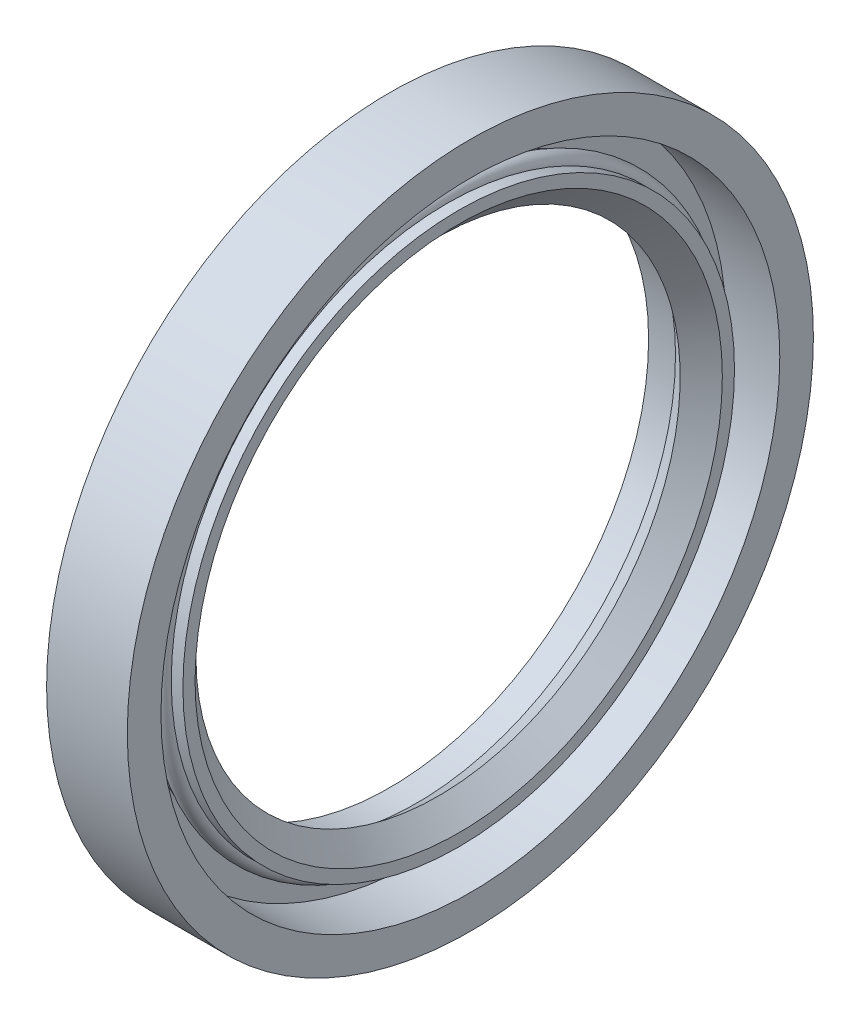
ISO-10303-21;
HEADER;
FILE_DESCRIPTION(('STEP AP214'),'2;1');
FILE_NAME('part.step','',(''),(''),'','','');
FILE_SCHEMA(('AUTOMOTIVE_DESIGN { 1 0 10303 214 1 1 1 1 }'));
ENDSEC;
DATA;
#1=APPLICATION_CONTEXT('core data for automotive mechanical design processes');
#2=APPLICATION_PROTOCOL_DEFINITION('international standard','automotive_design',2000,#1);
#3=PRODUCT_CONTEXT('',#1,'mechanical');
#4=PRODUCT('Part','Part','',(#3));
#5=PRODUCT_RELATED_PRODUCT_CATEGORY('part','',(#4));
#6=PRODUCT_DEFINITION_FORMATION('','',#4);
#7=PRODUCT_DEFINITION_CONTEXT('part definition',#1,'design');
#8=PRODUCT_DEFINITION('design','',#6,#7);
#9=PRODUCT_DEFINITION_SHAPE('','',#8);
#10=(LENGTH_UNIT() NAMED_UNIT(*) SI_UNIT(.MILLI.,.METRE.));
#11=(NAMED_UNIT(*) PLANE_ANGLE_UNIT() SI_UNIT($,.RADIAN.));
#12=(NAMED_UNIT(*) SI_UNIT($,.STERADIAN.) SOLID_ANGLE_UNIT());
#13=UNCERTAINTY_MEASURE_WITH_UNIT(LENGTH_MEASURE(1.E-05),#10,'distance_accuracy_value','');
#14=(GEOMETRIC_REPRESENTATION_CONTEXT(3) GLOBAL_UNCERTAINTY_ASSIGNED_CONTEXT((#13)) GLOBAL_UNIT_ASSIGNED_CONTEXT((#10,
#11,#12)) REPRESENTATION_CONTEXT('',''));
#15=CARTESIAN_POINT('',(0.,0.,0.));
#16=DIRECTION('',(0.,0.,1.));
#17=DIRECTION('',(1.,0.,0.));
#18=AXIS2_PLACEMENT_3D('',#15,#16,#17);
#19=CARTESIAN_POINT('',(0.,-42.9709186946959,-42.5));
#20=DIRECTION('',(-1.,0.,0.));
#21=DIRECTION('',(0.,0.,1.));
#22=AXIS2_PLACEMENT_3D('',#19,#20,#21);
#23=PLANE('',#22);
#24=CARTESIAN_POINT('',(0.,0.,0.));
#25=DIRECTION('',(-1.,0.,0.));
#26=DIRECTION('',(0.,0.,-1.));
#27=AXIS2_PLACEMENT_3D('',#24,#25,#26);
#28=CIRCLE('',#27,42.5);
#29=CARTESIAN_POINT('',(0.,0.,-42.5));
#30=VERTEX_POINT('',#29);
#31=EDGE_CURVE('E70',#30,#30,#28,.F.);
#32=ORIENTED_EDGE('',*,*,#31,.F.);
#33=EDGE_LOOP('',(#32));
#34=FACE_BOUND('',#33,.T.);
#35=CARTESIAN_POINT('',(0.,0.,0.));
#36=DIRECTION('',(1.,0.,0.));
#37=DIRECTION('',(0.,-1.16827621170232E-09,1.));
#38=AXIS2_PLACEMENT_3D('',#35,#36,#37);
#39=CIRCLE('',#38,32.083333333333);
#40=CARTESIAN_POINT('',(0.,-3.74821951254489E-08,32.083333333333));
#41=VERTEX_POINT('',#40);
#42=EDGE_CURVE('E66',#41,#41,#39,.T.);
#43=ORIENTED_EDGE('',*,*,#42,.T.);
#44=EDGE_LOOP('',(#43));
#45=FACE_BOUND('',#44,.T.);
#46=ADVANCED_FACE('F14',(#34,#45),#23,.T.);
#47=CARTESIAN_POINT('',(8.5555555,-34.5452483624029,34.166666666667));
#48=DIRECTION('',(1.,0.,0.));
#49=DIRECTION('',(0.,0.,-1.));
#50=AXIS2_PLACEMENT_3D('',#47,#48,#49);
#51=PLANE('',#50);
#52=CARTESIAN_POINT('',(8.5555555,0.,0.));
#53=DIRECTION('',(1.,0.,0.));
#54=DIRECTION('',(0.,0.,1.));
#55=AXIS2_PLACEMENT_3D('',#52,#53,#54);
#56=CIRCLE('',#55,34.166666666667);
#57=CARTESIAN_POINT('',(8.5555555,0.,34.166666666667));
#58=VERTEX_POINT('',#57);
#59=EDGE_CURVE('E62',#58,#58,#56,.T.);
#60=ORIENTED_EDGE('',*,*,#59,.T.);
#61=EDGE_LOOP('',(#60));
#62=FACE_BOUND('',#61,.T.);
#63=CARTESIAN_POINT('',(8.5555555,0.,0.));
#64=DIRECTION('',(-1.,0.,0.));
#65=DIRECTION('',(0.,0.,-1.));
#66=AXIS2_PLACEMENT_3D('',#63,#64,#65);
#67=CIRCLE('',#66,32.662036979167);
#68=CARTESIAN_POINT('',(8.5555555,0.,-32.662036979167));
#69=VERTEX_POINT('',#68);
#70=EDGE_CURVE('E58',#69,#69,#67,.F.);
#71=ORIENTED_EDGE('',*,*,#70,.F.);
#72=EDGE_LOOP('',(#71));
#73=FACE_BOUND('',#72,.T.);
#74=ADVANCED_FACE('F81',(#62,#73),#51,.T.);
#75=CARTESIAN_POINT('',(3.3333333333333,-38.7580835285489,38.333333333333));
#76=DIRECTION('',(1.,0.,0.));
#77=DIRECTION('',(0.,0.,-1.));
#78=AXIS2_PLACEMENT_3D('',#75,#76,#77);
#79=PLANE('',#78);
#80=CARTESIAN_POINT('',(3.3333333333333,0.,0.));
#81=DIRECTION('',(1.,0.,0.));
#82=DIRECTION('',(0.,0.,1.));
#83=AXIS2_PLACEMENT_3D('',#80,#81,#82);
#84=CIRCLE('',#83,38.333333333333);
#85=CARTESIAN_POINT('',(3.3333333333333,0.,38.333333333333));
#86=VERTEX_POINT('',#85);
#87=EDGE_CURVE('E54',#86,#86,#84,.T.);
#88=ORIENTED_EDGE('',*,*,#87,.T.);
#89=EDGE_LOOP('',(#88));
#90=FACE_BOUND('',#89,.T.);
#91=CARTESIAN_POINT('',(3.3333333333333,0.,0.));
#92=DIRECTION('',(-1.,0.,0.));
#93=DIRECTION('',(0.,0.,-1.));
#94=AXIS2_PLACEMENT_3D('',#91,#92,#93);
#95=CIRCLE('',#94,34.166666666667);
#96=CARTESIAN_POINT('',(3.3333333333333,0.,-34.166666666667));
#97=VERTEX_POINT('',#96);
#98=EDGE_CURVE('E50',#97,#97,#95,.F.);
#99=ORIENTED_EDGE('',*,*,#98,.F.);
#100=EDGE_LOOP('',(#99));
#101=FACE_BOUND('',#100,.T.);
#102=ADVANCED_FACE('F122',(#90,#101),#79,.T.);
#103=CARTESIAN_POINT('',(10.,-42.970918694696,42.5));
#104=DIRECTION('',(1.,0.,0.));
#105=DIRECTION('',(0.,0.,-1.));
#106=AXIS2_PLACEMENT_3D('',#103,#104,#105);
#107=PLANE('',#106);
#108=CARTESIAN_POINT('',(10.,0.,0.));
#109=DIRECTION('',(1.,0.,0.));
#110=DIRECTION('',(0.,0.,1.));
#111=AXIS2_PLACEMENT_3D('',#108,#109,#110);
#112=CIRCLE('',#111,42.5);
#113=CARTESIAN_POINT('',(10.,0.,42.5));
#114=VERTEX_POINT('',#113);
#115=EDGE_CURVE('E46',#114,#114,#112,.T.);
#116=ORIENTED_EDGE('',*,*,#115,.T.);
#117=EDGE_LOOP('',(#116));
#118=FACE_BOUND('',#117,.T.);
#119=CARTESIAN_POINT('',(10.,0.,0.));
#120=DIRECTION('',(-1.,0.,0.));
#121=DIRECTION('',(0.,0.,-1.));
#122=AXIS2_PLACEMENT_3D('',#119,#120,#121);
#123=CIRCLE('',#122,38.333333333333);
#124=CARTESIAN_POINT('',(10.,0.,-38.333333333333));
#125=VERTEX_POINT('',#124);
#126=EDGE_CURVE('E42',#125,#125,#123,.F.);
#127=ORIENTED_EDGE('',*,*,#126,.F.);
#128=EDGE_LOOP('',(#127));
#129=FACE_BOUND('',#128,.T.);
#130=ADVANCED_FACE('F99',(#118,#129),#107,.T.);
#131=CARTESIAN_POINT('',(10.,0.,0.));
#132=DIRECTION('',(1.,0.,0.));
#133=DIRECTION('',(0.,0.,1.));
#134=AXIS2_PLACEMENT_3D('',#131,#132,#133);
#135=CYLINDRICAL_SURFACE('',#134,42.5);
#136=ORIENTED_EDGE('',*,*,#31,.T.);
#137=EDGE_LOOP('',(#136));
#138=FACE_BOUND('',#137,.T.);
#139=ORIENTED_EDGE('',*,*,#115,.F.);
#140=EDGE_LOOP('',(#139));
#141=FACE_BOUND('',#140,.T.);
#142=ADVANCED_FACE('F76',(#138,#141),#135,.T.);
#143=CARTESIAN_POINT('',(10.,0.,0.));
#144=DIRECTION('',(1.,0.,0.));
#145=DIRECTION('',(0.,0.,1.));
#146=AXIS2_PLACEMENT_3D('',#143,#144,#145);
#147=CYLINDRICAL_SURFACE('',#146,32.083333333333);
#148=CARTESIAN_POINT('',(3.3333333333333,0.,0.));
#149=DIRECTION('',(1.,0.,0.));
#150=DIRECTION('',(0.,0.,1.));
#151=AXIS2_PLACEMENT_3D('',#148,#149,#150);
#152=CIRCLE('',#151,32.083333333333);
#153=CARTESIAN_POINT('',(3.3333333333333,0.,32.083333333333));
#154=VERTEX_POINT('',#153);
#155=EDGE_CURVE('E36',#154,#154,#152,.T.);
#156=ORIENTED_EDGE('',*,*,#155,.T.);
#157=EDGE_LOOP('',(#156));
#158=FACE_BOUND('',#157,.T.);
#159=ORIENTED_EDGE('',*,*,#42,.F.);
#160=EDGE_LOOP('',(#159));
#161=FACE_BOUND('',#160,.T.);
#162=ADVANCED_FACE('F85',(#158,#161),#147,.F.);
#163=CARTESIAN_POINT('',(3.3333333333333,0.,0.));
#164=DIRECTION('',(-1.,0.,0.));
#165=DIRECTION('',(0.,0.,-1.));
#166=AXIS2_PLACEMENT_3D('',#163,#164,#165);
#167=CONICAL_SURFACE('',#166,32.083333333333,0.66320299270601);
#168=ORIENTED_EDGE('',*,*,#155,.F.);
#169=EDGE_LOOP('',(#168));
#170=FACE_BOUND('',#169,.T.);
#171=CARTESIAN_POINT('',(5.99999999999999,0.,0.));
#172=DIRECTION('',(1.,0.,0.));
#173=DIRECTION('',(0.,0.,1.));
#174=AXIS2_PLACEMENT_3D('',#171,#172,#173);
#175=CIRCLE('',#174,30.);
#176=CARTESIAN_POINT('',(5.99999999999999,0.,30.));
#177=VERTEX_POINT('',#176);
#178=EDGE_CURVE('E30',#177,#177,#175,.T.);
#179=ORIENTED_EDGE('',*,*,#178,.T.);
#180=EDGE_LOOP('',(#179));
#181=FACE_BOUND('',#180,.T.);
#182=ADVANCED_FACE('F87',(#170,#181),#167,.F.);
#183=CARTESIAN_POINT('',(8.55555550000001,0.,0.));
#184=DIRECTION('',(1.,0.,0.));
#185=DIRECTION('',(0.,0.,1.));
#186=AXIS2_PLACEMENT_3D('',#183,#184,#185);
#187=CONICAL_SURFACE('',#186,32.662036979167,0.805803494084048);
#188=ORIENTED_EDGE('',*,*,#70,.T.);
#189=EDGE_LOOP('',(#188));
#190=FACE_BOUND('',#189,.T.);
#191=ORIENTED_EDGE('',*,*,#178,.F.);
#192=EDGE_LOOP('',(#191));
#193=FACE_BOUND('',#192,.T.);
#194=ADVANCED_FACE('F96',(#190,#193),#187,.F.);
#195=CARTESIAN_POINT('',(10.,0.,0.));
#196=DIRECTION('',(1.,0.,0.));
#197=DIRECTION('',(0.,0.,1.));
#198=AXIS2_PLACEMENT_3D('',#195,#196,#197);
#199=CYLINDRICAL_SURFACE('',#198,34.166666666667);
#200=CARTESIAN_POINT('',(7.111111,0.,0.));
#201=DIRECTION('',(1.,0.,0.));
#202=DIRECTION('',(0.,0.,1.));
#203=AXIS2_PLACEMENT_3D('',#200,#201,#202);
#204=CIRCLE('',#203,34.166666666667);
#205=CARTESIAN_POINT('',(7.111111,0.,34.166666666667));
#206=VERTEX_POINT('',#205);
#207=EDGE_CURVE('E22',#206,#206,#204,.T.);
#208=ORIENTED_EDGE('',*,*,#207,.T.);
#209=EDGE_LOOP('',(#208));
#210=FACE_BOUND('',#209,.T.);
#211=ORIENTED_EDGE('',*,*,#59,.F.);
#212=EDGE_LOOP('',(#211));
#213=FACE_BOUND('',#212,.T.);
#214=ADVANCED_FACE('F105',(#210,#213),#199,.T.);
#215=CARTESIAN_POINT('',(6.,0.,0.));
#216=DIRECTION('',(1.,0.,0.));
#217=DIRECTION('',(0.,0.,1.));
#218=AXIS2_PLACEMENT_3D('',#215,#216,#217);
#219=TOROIDAL_SURFACE('',#218,34.166666666667,1.111111);
#220=CARTESIAN_POINT('',(4.888889,0.,0.));
#221=DIRECTION('',(1.,0.,0.));
#222=DIRECTION('',(0.,0.,1.));
#223=AXIS2_PLACEMENT_3D('',#220,#221,#222);
#224=CIRCLE('',#223,34.166666666667);
#225=CARTESIAN_POINT('',(4.888889,0.,34.166666666667));
#226=VERTEX_POINT('',#225);
#227=EDGE_CURVE('E9',#226,#226,#224,.T.);
#228=ORIENTED_EDGE('',*,*,#227,.T.);
#229=EDGE_LOOP('',(#228));
#230=FACE_BOUND('',#229,.T.);
#231=ORIENTED_EDGE('',*,*,#207,.F.);
#232=EDGE_LOOP('',(#231));
#233=FACE_BOUND('',#232,.T.);
#234=ADVANCED_FACE('F109',(#230,#233),#219,.T.);
#235=CARTESIAN_POINT('',(10.,0.,0.));
#236=DIRECTION('',(1.,0.,0.));
#237=DIRECTION('',(0.,0.,1.));
#238=AXIS2_PLACEMENT_3D('',#235,#236,#237);
#239=CYLINDRICAL_SURFACE('',#238,34.166666666667);
#240=ORIENTED_EDGE('',*,*,#98,.T.);
#241=EDGE_LOOP('',(#240));
#242=FACE_BOUND('',#241,.T.);
#243=ORIENTED_EDGE('',*,*,#227,.F.);
#244=EDGE_LOOP('',(#243));
#245=FACE_BOUND('',#244,.T.);
#246=ADVANCED_FACE('F111',(#242,#245),#239,.T.);
#247=CARTESIAN_POINT('',(10.,0.,0.));
#248=DIRECTION('',(1.,0.,0.));
#249=DIRECTION('',(0.,0.,1.));
#250=AXIS2_PLACEMENT_3D('',#247,#248,#249);
#251=CYLINDRICAL_SURFACE('',#250,38.333333333333);
#252=ORIENTED_EDGE('',*,*,#126,.T.);
#253=EDGE_LOOP('',(#252));
#254=FACE_BOUND('',#253,.T.);
#255=ORIENTED_EDGE('',*,*,#87,.F.);
#256=EDGE_LOOP('',(#255));
#257=FACE_BOUND('',#256,.T.);
#258=ADVANCED_FACE('F16',(#254,#257),#251,.F.);
#259=CLOSED_SHELL('',(#46,#74,#102,#130,#142,#162,#182,#194,#214,#234,#246,#258));
#260=MANIFOLD_SOLID_BREP('B1',#259);
#261=ADVANCED_BREP_SHAPE_REPRESENTATION('',(#18,#260),#14);
#262=SHAPE_DEFINITION_REPRESENTATION(#9,#261);
ENDSEC;
END-ISO-10303-21;
